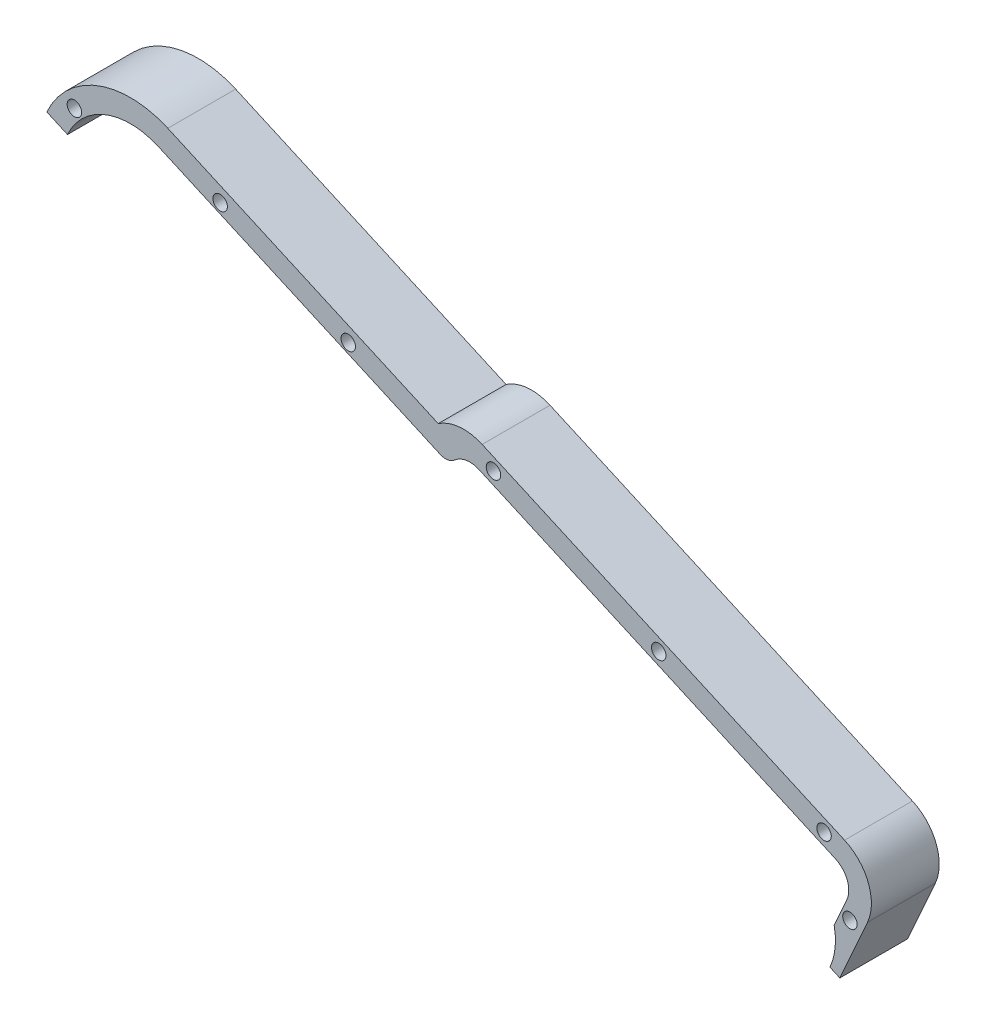
ISO-10303-21;
HEADER;
FILE_DESCRIPTION(('STEP AP214'),'2;1');
FILE_NAME('part.step','',(''),(''),'','','');
FILE_SCHEMA(('AUTOMOTIVE_DESIGN { 1 0 10303 214 1 1 1 1 }'));
ENDSEC;
DATA;
#1=APPLICATION_CONTEXT('core data for automotive mechanical design processes');
#2=APPLICATION_PROTOCOL_DEFINITION('international standard','automotive_design',2000,#1);
#3=PRODUCT_CONTEXT('',#1,'mechanical');
#4=PRODUCT('Part','Part','',(#3));
#5=PRODUCT_RELATED_PRODUCT_CATEGORY('part','',(#4));
#6=PRODUCT_DEFINITION_FORMATION('','',#4);
#7=PRODUCT_DEFINITION_CONTEXT('part definition',#1,'design');
#8=PRODUCT_DEFINITION('design','',#6,#7);
#9=PRODUCT_DEFINITION_SHAPE('','',#8);
#10=(LENGTH_UNIT() NAMED_UNIT(*) SI_UNIT(.MILLI.,.METRE.));
#11=(NAMED_UNIT(*) PLANE_ANGLE_UNIT() SI_UNIT($,.RADIAN.));
#12=(NAMED_UNIT(*) SI_UNIT($,.STERADIAN.) SOLID_ANGLE_UNIT());
#13=UNCERTAINTY_MEASURE_WITH_UNIT(LENGTH_MEASURE(1.E-05),#10,'distance_accuracy_value','');
#14=(GEOMETRIC_REPRESENTATION_CONTEXT(3) GLOBAL_UNCERTAINTY_ASSIGNED_CONTEXT((#13)) GLOBAL_UNIT_ASSIGNED_CONTEXT((#10,
#11,#12)) REPRESENTATION_CONTEXT('',''));
#15=CARTESIAN_POINT('',(0.,0.,0.));
#16=DIRECTION('',(0.,0.,1.));
#17=DIRECTION('',(1.,0.,0.));
#18=AXIS2_PLACEMENT_3D('',#15,#16,#17);
#19=CARTESIAN_POINT('',(-76.7868238041878,81.7037234737728,15.));
#20=DIRECTION('',(0.,0.,1.));
#21=DIRECTION('',(1.,0.,0.));
#22=AXIS2_PLACEMENT_3D('',#19,#20,#21);
#23=PLANE('',#22);
#24=CARTESIAN_POINT('',(-88.7287511209119,70.6042507911827,15.));
#25=DIRECTION('',(0.,0.,1.));
#26=DIRECTION('',(1.,0.,0.));
#27=AXIS2_PLACEMENT_3D('',#24,#25,#26);
#28=CIRCLE('',#27,14.);
#29=CARTESIAN_POINT('',(-75.941706574224,64.904119936455,15.));
#30=VERTEX_POINT('',#29);
#31=CARTESIAN_POINT('',(-75.0118010764204,73.4051937532801,15.));
#32=VERTEX_POINT('',#31);
#33=EDGE_CURVE('E146',#30,#32,#28,.T.);
#34=ORIENTED_EDGE('',*,*,#33,.F.);
#35=DIRECTION('',(-0.913360324763423,0.40715220390912,0.));
#36=VECTOR('',#35,1.);
#37=CARTESIAN_POINT('',(-249.039738927612,142.066706764681,15.));
#38=LINE('',#37,#36);
#39=CARTESIAN_POINT('',(-73.7605036151903,63.9317965632302,15.));
#40=VERTEX_POINT('',#39);
#41=EDGE_CURVE('E321',#40,#30,#38,.T.);
#42=ORIENTED_EDGE('',*,*,#41,.F.);
#43=DIRECTION('',(0.40715220390912,0.913360324763424,0.));
#44=VECTOR('',#43,1.);
#45=CARTESIAN_POINT('',(-79.8677866738272,50.2313916917789,15.));
#46=LINE('',#45,#44);
#47=CARTESIAN_POINT('',(-67.6532205565535,77.6322014346816,15.));
#48=VERTEX_POINT('',#47);
#49=EDGE_CURVE('E236',#40,#48,#46,.T.);
#50=ORIENTED_EDGE('',*,*,#49,.T.);
#51=CARTESIAN_POINT('',(-76.7868238041878,81.7037234737728,15.));
#52=DIRECTION('',(0.,0.,1.));
#53=DIRECTION('',(1.,0.,0.));
#54=AXIS2_PLACEMENT_3D('',#51,#52,#53);
#55=CIRCLE('',#54,9.99999999999999);
#56=CARTESIAN_POINT('',(-72.7153017650966,90.837326721407,15.));
#57=VERTEX_POINT('',#56);
#58=EDGE_CURVE('E223',#48,#57,#55,.T.);
#59=ORIENTED_EDGE('',*,*,#58,.T.);
#60=DIRECTION('',(-0.913360324763423,0.40715220390912,0.));
#61=VECTOR('',#60,1.);
#62=CARTESIAN_POINT('',(-72.7153017650966,90.837326721407,15.));
#63=LINE('',#62,#61);
#64=CARTESIAN_POINT('',(-152.817002246849,126.544575004237,15.));
#65=VERTEX_POINT('',#64);
#66=EDGE_CURVE('E226',#57,#65,#63,.T.);
#67=ORIENTED_EDGE('',*,*,#66,.T.);
#68=CARTESIAN_POINT('',(-156.88852428594,117.410971756603,15.));
#69=DIRECTION('',(0.,0.,1.));
#70=DIRECTION('',(1.,0.,0.));
#71=AXIS2_PLACEMENT_3D('',#68,#69,#70);
#72=CIRCLE('',#71,9.99999999999999);
#73=CARTESIAN_POINT('',(-162.524605275697,125.671394934437,15.));
#74=VERTEX_POINT('',#73);
#75=EDGE_CURVE('E229',#65,#74,#72,.T.);
#76=ORIENTED_EDGE('',*,*,#75,.T.);
#77=DIRECTION('',(-0.913360324763423,0.40715220390912,0.));
#78=VECTOR('',#77,1.);
#79=CARTESIAN_POINT('',(-162.524605275697,125.671394934437,15.));
#80=LINE('',#79,#78);
#81=CARTESIAN_POINT('',(-222.299360221993,152.317421211981,15.));
#82=VERTEX_POINT('',#81);
#83=EDGE_CURVE('E231',#74,#82,#80,.T.);
#84=ORIENTED_EDGE('',*,*,#83,.T.);
#85=CARTESIAN_POINT('',(-230.544192351153,133.821874635521,15.));
#86=DIRECTION('',(0.,0.,1.));
#87=DIRECTION('',(1.,0.,0.));
#88=AXIS2_PLACEMENT_3D('',#85,#86,#87);
#89=CIRCLE('',#88,20.25);
#90=CARTESIAN_POINT('',(-249.039738927612,142.066706764681,15.));
#91=VERTEX_POINT('',#90);
#92=EDGE_CURVE('E233',#82,#91,#89,.T.);
#93=ORIENTED_EDGE('',*,*,#92,.T.);
#94=CARTESIAN_POINT('',(-244.472937303795,140.030945745135,15.));
#95=VERTEX_POINT('',#94);
#96=EDGE_CURVE('E317',#95,#91,#38,.T.);
#97=ORIENTED_EDGE('',*,*,#96,.F.);
#98=CARTESIAN_POINT('',(-230.544192351153,133.821874635521,15.));
#99=DIRECTION('',(0.,0.,1.));
#100=DIRECTION('',(1.,0.,0.));
#101=AXIS2_PLACEMENT_3D('',#98,#99,#100);
#102=CIRCLE('',#101,15.25);
#103=CARTESIAN_POINT('',(-224.335121241539,147.750619588163,15.));
#104=VERTEX_POINT('',#103);
#105=EDGE_CURVE('E310',#104,#95,#102,.T.);
#106=ORIENTED_EDGE('',*,*,#105,.F.);
#107=DIRECTION('',(-0.913360324763423,0.40715220390912,0.));
#108=VECTOR('',#107,1.);
#109=CARTESIAN_POINT('',(-147.743052941724,113.607873768429,15.));
#110=LINE('',#109,#108);
#111=CARTESIAN_POINT('',(-162.103514483741,120.009392870432,15.));
#112=VERTEX_POINT('',#111);
#113=EDGE_CURVE('E162',#112,#104,#110,.T.);
#114=ORIENTED_EDGE('',*,*,#113,.F.);
#115=CARTESIAN_POINT('',(-160.882057872014,122.749473844722,15.));
#116=DIRECTION('',(0.,0.,1.));
#117=DIRECTION('',(1.,0.,0.));
#118=AXIS2_PLACEMENT_3D('',#115,#116,#117);
#119=CIRCLE('',#118,3.);
#120=CARTESIAN_POINT('',(-158.874492831978,120.520195349328,15.));
#121=VERTEX_POINT('',#120);
#122=EDGE_CURVE('E43',#112,#121,#119,.T.);
#123=ORIENTED_EDGE('',*,*,#122,.T.);
#124=CARTESIAN_POINT('',(-155.528551098586,116.804731190338,15.));
#125=DIRECTION('',(0.,0.,1.));
#126=DIRECTION('',(1.,0.,0.));
#127=AXIS2_PLACEMENT_3D('',#124,#125,#126);
#128=CIRCLE('',#127,5.);
#129=CARTESIAN_POINT('',(-153.49279007904,121.371532814155,15.));
#130=VERTEX_POINT('',#129);
#131=EDGE_CURVE('E268',#121,#130,#128,.F.);
#132=ORIENTED_EDGE('',*,*,#131,.T.);
#133=DIRECTION('',(-0.913360324763423,0.40715220390912,0.));
#134=VECTOR('',#133,1.);
#135=CARTESIAN_POINT('',(-158.059591702857,123.4072938337,15.));
#136=LINE('',#135,#134);
#137=CARTESIAN_POINT('',(-74.7510627846422,86.27052509759,15.));
#138=VERTEX_POINT('',#137);
#139=EDGE_CURVE('E168',#138,#130,#136,.T.);
#140=ORIENTED_EDGE('',*,*,#139,.F.);
#141=CARTESIAN_POINT('',(-76.7868238041878,81.7037234737728,15.));
#142=DIRECTION('',(0.,0.,1.));
#143=DIRECTION('',(1.,0.,0.));
#144=AXIS2_PLACEMENT_3D('',#141,#142,#143);
#145=CIRCLE('',#144,5.);
#146=CARTESIAN_POINT('',(-72.2200221803707,79.6679624542272,15.));
#147=VERTEX_POINT('',#146);
#148=EDGE_CURVE('E166',#138,#147,#145,.F.);
#149=ORIENTED_EDGE('',*,*,#148,.T.);
#150=DIRECTION('',(0.40715220390912,0.913360324763423,0.));
#151=VECTOR('',#150,1.);
#152=CARTESIAN_POINT('',(-70.1842611608251,84.2347640780443,15.));
#153=LINE('',#152,#151);
#154=EDGE_CURVE('E159',#32,#147,#153,.T.);
#155=ORIENTED_EDGE('',*,*,#154,.F.);
#156=EDGE_LOOP('',(#34,#42,#50,#59,#67,#76,#84,#93,#97,#106,#114,#123,#132,#140,#149,#155));
#157=FACE_BOUND('',#156,.T.);
#158=CARTESIAN_POINT('',(-242.947351213455,145.810375385677,15.));
#159=DIRECTION('',(0.,0.,1.));
#160=DIRECTION('',(1.,0.,0.));
#161=AXIS2_PLACEMENT_3D('',#158,#159,#160);
#162=CIRCLE('',#161,1.59999999999999);
#163=CARTESIAN_POINT('',(-241.347351213455,145.810375385677,15.));
#164=VERTEX_POINT('',#163);
#165=EDGE_CURVE('E184',#164,#164,#162,.T.);
#166=ORIENTED_EDGE('',*,*,#165,.F.);
#167=EDGE_LOOP('',(#166));
#168=FACE_BOUND('',#167,.T.);
#169=CARTESIAN_POINT('',(-182.419602219367,131.25549106178,15.));
#170=DIRECTION('',(0.,0.,1.));
#171=DIRECTION('',(1.,0.,0.));
#172=AXIS2_PLACEMENT_3D('',#169,#170,#171);
#173=CIRCLE('',#172,1.59999999999999);
#174=CARTESIAN_POINT('',(-180.819602219367,131.25549106178,15.));
#175=VERTEX_POINT('',#174);
#176=EDGE_CURVE('E183',#175,#175,#173,.T.);
#177=ORIENTED_EDGE('',*,*,#176,.F.);
#178=EDGE_LOOP('',(#177));
#179=FACE_BOUND('',#178,.T.);
#180=CARTESIAN_POINT('',(-210.733772287033,143.877209382963,15.));
#181=DIRECTION('',(0.,0.,1.));
#182=DIRECTION('',(1.,0.,0.));
#183=AXIS2_PLACEMENT_3D('',#180,#181,#182);
#184=CIRCLE('',#183,1.59999999999999);
#185=CARTESIAN_POINT('',(-209.133772287033,143.877209382963,15.));
#186=VERTEX_POINT('',#185);
#187=EDGE_CURVE('E190',#186,#186,#184,.T.);
#188=ORIENTED_EDGE('',*,*,#187,.F.);
#189=EDGE_LOOP('',(#188));
#190=FACE_BOUND('',#189,.T.);
#191=CARTESIAN_POINT('',(-71.5234221100948,76.0728618517278,15.));
#192=DIRECTION('',(0.,0.,1.));
#193=DIRECTION('',(1.,0.,0.));
#194=AXIS2_PLACEMENT_3D('',#191,#192,#193);
#195=CIRCLE('',#194,1.60000000000001);
#196=CARTESIAN_POINT('',(-69.9234221100948,76.0728618517278,15.));
#197=VERTEX_POINT('',#196);
#198=EDGE_CURVE('E199',#197,#197,#195,.T.);
#199=ORIENTED_EDGE('',*,*,#198,.F.);
#200=EDGE_LOOP('',(#199));
#201=FACE_BOUND('',#200,.T.);
#202=CARTESIAN_POINT('',(-77.2496195252085,90.1214618945486,15.));
#203=DIRECTION('',(0.,0.,1.));
#204=DIRECTION('',(1.,0.,0.));
#205=AXIS2_PLACEMENT_3D('',#202,#203,#204);
#206=CIRCLE('',#205,1.60000000000001);
#207=CARTESIAN_POINT('',(-75.6496195252085,90.1214618945486,15.));
#208=VERTEX_POINT('',#207);
#209=EDGE_CURVE('E205',#208,#208,#206,.T.);
#210=ORIENTED_EDGE('',*,*,#209,.F.);
#211=EDGE_LOOP('',(#210));
#212=FACE_BOUND('',#211,.T.);
#213=CARTESIAN_POINT('',(-150.318445506282,122.693638207278,15.));
#214=DIRECTION('',(0.,0.,1.));
#215=DIRECTION('',(1.,0.,0.));
#216=AXIS2_PLACEMENT_3D('',#213,#214,#215);
#217=CIRCLE('',#216,1.59999999999999);
#218=CARTESIAN_POINT('',(-148.718445506282,122.693638207278,15.));
#219=VERTEX_POINT('',#218);
#220=EDGE_CURVE('E217',#219,#219,#217,.T.);
#221=ORIENTED_EDGE('',*,*,#220,.F.);
#222=EDGE_LOOP('',(#221));
#223=FACE_BOUND('',#222,.T.);
#224=CARTESIAN_POINT('',(-113.784032515745,106.407550050913,15.));
#225=DIRECTION('',(0.,0.,1.));
#226=DIRECTION('',(1.,0.,0.));
#227=AXIS2_PLACEMENT_3D('',#224,#225,#226);
#228=CIRCLE('',#227,1.60000000000001);
#229=CARTESIAN_POINT('',(-112.184032515745,106.407550050913,15.));
#230=VERTEX_POINT('',#229);
#231=EDGE_CURVE('E211',#230,#230,#228,.T.);
#232=ORIENTED_EDGE('',*,*,#231,.F.);
#233=EDGE_LOOP('',(#232));
#234=FACE_BOUND('',#233,.T.);
#235=ADVANCED_FACE('F35',(#157,#168,#179,#190,#201,#212,#223,#234),#23,.T.);
#236=CARTESIAN_POINT('',(-76.7868238041878,81.7037234737728,0.));
#237=DIRECTION('',(0.,0.,1.));
#238=DIRECTION('',(1.,0.,0.));
#239=AXIS2_PLACEMENT_3D('',#236,#237,#238);
#240=PLANE('',#239);
#241=DIRECTION('',(-0.913360324763423,0.40715220390912,0.));
#242=VECTOR('',#241,1.);
#243=CARTESIAN_POINT('',(-249.039738927612,142.066706764681,0.));
#244=LINE('',#243,#242);
#245=CARTESIAN_POINT('',(-73.7605036151903,63.9317965632302,0.));
#246=VERTEX_POINT('',#245);
#247=CARTESIAN_POINT('',(-75.941706574224,64.904119936455,0.));
#248=VERTEX_POINT('',#247);
#249=EDGE_CURVE('E318',#246,#248,#244,.T.);
#250=ORIENTED_EDGE('',*,*,#249,.T.);
#251=CARTESIAN_POINT('',(-88.7287511209119,70.6042507911827,0.));
#252=DIRECTION('',(0.,0.,1.));
#253=DIRECTION('',(1.,0.,0.));
#254=AXIS2_PLACEMENT_3D('',#251,#252,#253);
#255=CIRCLE('',#254,14.);
#256=CARTESIAN_POINT('',(-75.0118010764204,73.4051937532801,0.));
#257=VERTEX_POINT('',#256);
#258=EDGE_CURVE('E50',#248,#257,#255,.T.);
#259=ORIENTED_EDGE('',*,*,#258,.T.);
#260=DIRECTION('',(0.40715220390912,0.913360324763423,0.));
#261=VECTOR('',#260,1.);
#262=CARTESIAN_POINT('',(-70.1842611608251,84.2347640780443,0.));
#263=LINE('',#262,#261);
#264=CARTESIAN_POINT('',(-72.2200221803707,79.6679624542272,0.));
#265=VERTEX_POINT('',#264);
#266=EDGE_CURVE('E161',#257,#265,#263,.T.);
#267=ORIENTED_EDGE('',*,*,#266,.T.);
#268=CARTESIAN_POINT('',(-76.7868238041878,81.7037234737728,0.));
#269=DIRECTION('',(0.,0.,1.));
#270=DIRECTION('',(1.,0.,0.));
#271=AXIS2_PLACEMENT_3D('',#268,#269,#270);
#272=CIRCLE('',#271,5.);
#273=CARTESIAN_POINT('',(-74.7510627846422,86.27052509759,0.));
#274=VERTEX_POINT('',#273);
#275=EDGE_CURVE('E279',#265,#274,#272,.T.);
#276=ORIENTED_EDGE('',*,*,#275,.T.);
#277=DIRECTION('',(-0.913360324763423,0.40715220390912,0.));
#278=VECTOR('',#277,1.);
#279=CARTESIAN_POINT('',(-158.059591702857,123.4072938337,0.));
#280=LINE('',#279,#278);
#281=CARTESIAN_POINT('',(-153.49279007904,121.371532814155,0.));
#282=VERTEX_POINT('',#281);
#283=EDGE_CURVE('E177',#274,#282,#280,.T.);
#284=ORIENTED_EDGE('',*,*,#283,.T.);
#285=CARTESIAN_POINT('',(-155.528551098586,116.804731190338,0.));
#286=DIRECTION('',(0.,0.,1.));
#287=DIRECTION('',(1.,0.,0.));
#288=AXIS2_PLACEMENT_3D('',#285,#286,#287);
#289=CIRCLE('',#288,5.);
#290=CARTESIAN_POINT('',(-158.874492831978,120.520195349328,0.));
#291=VERTEX_POINT('',#290);
#292=EDGE_CURVE('E270',#282,#291,#289,.T.);
#293=ORIENTED_EDGE('',*,*,#292,.T.);
#294=CARTESIAN_POINT('',(-160.882057872014,122.749473844722,0.));
#295=DIRECTION('',(0.,0.,1.));
#296=DIRECTION('',(1.,0.,0.));
#297=AXIS2_PLACEMENT_3D('',#294,#295,#296);
#298=CIRCLE('',#297,3.);
#299=CARTESIAN_POINT('',(-162.103514483741,120.009392870432,0.));
#300=VERTEX_POINT('',#299);
#301=EDGE_CURVE('E287',#291,#300,#298,.F.);
#302=ORIENTED_EDGE('',*,*,#301,.T.);
#303=DIRECTION('',(-0.913360324763423,0.40715220390912,0.));
#304=VECTOR('',#303,1.);
#305=CARTESIAN_POINT('',(-147.743052941724,113.607873768429,0.));
#306=LINE('',#305,#304);
#307=CARTESIAN_POINT('',(-224.335121241539,147.750619588163,0.));
#308=VERTEX_POINT('',#307);
#309=EDGE_CURVE('E303',#300,#308,#306,.T.);
#310=ORIENTED_EDGE('',*,*,#309,.T.);
#311=CARTESIAN_POINT('',(-230.544192351153,133.821874635521,0.));
#312=DIRECTION('',(0.,0.,1.));
#313=DIRECTION('',(1.,0.,0.));
#314=AXIS2_PLACEMENT_3D('',#311,#312,#313);
#315=CIRCLE('',#314,15.25);
#316=CARTESIAN_POINT('',(-244.472937303795,140.030945745135,0.));
#317=VERTEX_POINT('',#316);
#318=EDGE_CURVE('E309',#308,#317,#315,.T.);
#319=ORIENTED_EDGE('',*,*,#318,.T.);
#320=CARTESIAN_POINT('',(-249.039738927612,142.066706764681,0.));
#321=VERTEX_POINT('',#320);
#322=EDGE_CURVE('E320',#317,#321,#244,.T.);
#323=ORIENTED_EDGE('',*,*,#322,.T.);
#324=CARTESIAN_POINT('',(-230.544192351153,133.821874635521,0.));
#325=DIRECTION('',(0.,0.,1.));
#326=DIRECTION('',(1.,0.,0.));
#327=AXIS2_PLACEMENT_3D('',#324,#325,#326);
#328=CIRCLE('',#327,20.25);
#329=CARTESIAN_POINT('',(-222.299360221993,152.317421211981,0.));
#330=VERTEX_POINT('',#329);
#331=EDGE_CURVE('E247',#330,#321,#328,.T.);
#332=ORIENTED_EDGE('',*,*,#331,.F.);
#333=DIRECTION('',(-0.913360324763423,0.40715220390912,0.));
#334=VECTOR('',#333,1.);
#335=CARTESIAN_POINT('',(-162.524605275697,125.671394934437,0.));
#336=LINE('',#335,#334);
#337=CARTESIAN_POINT('',(-162.524605275697,125.671394934437,0.));
#338=VERTEX_POINT('',#337);
#339=EDGE_CURVE('E245',#338,#330,#336,.T.);
#340=ORIENTED_EDGE('',*,*,#339,.F.);
#341=CARTESIAN_POINT('',(-156.88852428594,117.410971756603,0.));
#342=DIRECTION('',(0.,0.,1.));
#343=DIRECTION('',(1.,0.,0.));
#344=AXIS2_PLACEMENT_3D('',#341,#342,#343);
#345=CIRCLE('',#344,9.99999999999999);
#346=CARTESIAN_POINT('',(-152.817002246849,126.544575004237,0.));
#347=VERTEX_POINT('',#346);
#348=EDGE_CURVE('E243',#347,#338,#345,.T.);
#349=ORIENTED_EDGE('',*,*,#348,.F.);
#350=DIRECTION('',(-0.913360324763423,0.40715220390912,0.));
#351=VECTOR('',#350,1.);
#352=CARTESIAN_POINT('',(-72.7153017650966,90.837326721407,0.));
#353=LINE('',#352,#351);
#354=CARTESIAN_POINT('',(-72.7153017650966,90.837326721407,0.));
#355=VERTEX_POINT('',#354);
#356=EDGE_CURVE('E241',#355,#347,#353,.T.);
#357=ORIENTED_EDGE('',*,*,#356,.F.);
#358=CARTESIAN_POINT('',(-76.7868238041878,81.7037234737728,0.));
#359=DIRECTION('',(0.,0.,1.));
#360=DIRECTION('',(1.,0.,0.));
#361=AXIS2_PLACEMENT_3D('',#358,#359,#360);
#362=CIRCLE('',#361,9.99999999999999);
#363=CARTESIAN_POINT('',(-67.6532205565535,77.6322014346816,0.));
#364=VERTEX_POINT('',#363);
#365=EDGE_CURVE('E220',#364,#355,#362,.T.);
#366=ORIENTED_EDGE('',*,*,#365,.F.);
#367=DIRECTION('',(0.40715220390912,0.913360324763424,0.));
#368=VECTOR('',#367,1.);
#369=CARTESIAN_POINT('',(-79.8677866738272,50.2313916917789,0.));
#370=LINE('',#369,#368);
#371=EDGE_CURVE('E227',#246,#364,#370,.T.);
#372=ORIENTED_EDGE('',*,*,#371,.F.);
#373=EDGE_LOOP('',(#250,#259,#267,#276,#284,#293,#302,#310,#319,#323,#332,#340,#349,#357,#366,#372));
#374=FACE_BOUND('',#373,.T.);
#375=CARTESIAN_POINT('',(-242.947351213455,145.810375385677,0.));
#376=DIRECTION('',(0.,0.,1.));
#377=DIRECTION('',(1.,0.,0.));
#378=AXIS2_PLACEMENT_3D('',#375,#376,#377);
#379=CIRCLE('',#378,1.59999999999999);
#380=CARTESIAN_POINT('',(-241.347351213455,145.810375385677,0.));
#381=VERTEX_POINT('',#380);
#382=EDGE_CURVE('E180',#381,#381,#379,.T.);
#383=ORIENTED_EDGE('',*,*,#382,.T.);
#384=EDGE_LOOP('',(#383));
#385=FACE_BOUND('',#384,.T.);
#386=CARTESIAN_POINT('',(-182.419602219367,131.25549106178,0.));
#387=DIRECTION('',(0.,0.,1.));
#388=DIRECTION('',(1.,0.,0.));
#389=AXIS2_PLACEMENT_3D('',#386,#387,#388);
#390=CIRCLE('',#389,1.59999999999999);
#391=CARTESIAN_POINT('',(-180.819602219367,131.25549106178,0.));
#392=VERTEX_POINT('',#391);
#393=EDGE_CURVE('E187',#392,#392,#390,.T.);
#394=ORIENTED_EDGE('',*,*,#393,.T.);
#395=EDGE_LOOP('',(#394));
#396=FACE_BOUND('',#395,.T.);
#397=CARTESIAN_POINT('',(-210.733772287033,143.877209382963,0.));
#398=DIRECTION('',(0.,0.,1.));
#399=DIRECTION('',(1.,0.,0.));
#400=AXIS2_PLACEMENT_3D('',#397,#398,#399);
#401=CIRCLE('',#400,1.59999999999999);
#402=CARTESIAN_POINT('',(-209.133772287033,143.877209382963,0.));
#403=VERTEX_POINT('',#402);
#404=EDGE_CURVE('E193',#403,#403,#401,.T.);
#405=ORIENTED_EDGE('',*,*,#404,.T.);
#406=EDGE_LOOP('',(#405));
#407=FACE_BOUND('',#406,.T.);
#408=CARTESIAN_POINT('',(-150.318445506282,122.693638207278,0.));
#409=DIRECTION('',(0.,0.,1.));
#410=DIRECTION('',(1.,0.,0.));
#411=AXIS2_PLACEMENT_3D('',#408,#409,#410);
#412=CIRCLE('',#411,1.59999999999999);
#413=CARTESIAN_POINT('',(-148.718445506282,122.693638207278,0.));
#414=VERTEX_POINT('',#413);
#415=EDGE_CURVE('E214',#414,#414,#412,.T.);
#416=ORIENTED_EDGE('',*,*,#415,.T.);
#417=EDGE_LOOP('',(#416));
#418=FACE_BOUND('',#417,.T.);
#419=CARTESIAN_POINT('',(-113.784032515745,106.407550050913,0.));
#420=DIRECTION('',(0.,0.,1.));
#421=DIRECTION('',(1.,0.,0.));
#422=AXIS2_PLACEMENT_3D('',#419,#420,#421);
#423=CIRCLE('',#422,1.60000000000001);
#424=CARTESIAN_POINT('',(-112.184032515745,106.407550050913,0.));
#425=VERTEX_POINT('',#424);
#426=EDGE_CURVE('E208',#425,#425,#423,.T.);
#427=ORIENTED_EDGE('',*,*,#426,.T.);
#428=EDGE_LOOP('',(#427));
#429=FACE_BOUND('',#428,.T.);
#430=CARTESIAN_POINT('',(-77.2496195252085,90.1214618945486,0.));
#431=DIRECTION('',(0.,0.,1.));
#432=DIRECTION('',(1.,0.,0.));
#433=AXIS2_PLACEMENT_3D('',#430,#431,#432);
#434=CIRCLE('',#433,1.60000000000001);
#435=CARTESIAN_POINT('',(-75.6496195252085,90.1214618945486,0.));
#436=VERTEX_POINT('',#435);
#437=EDGE_CURVE('E202',#436,#436,#434,.T.);
#438=ORIENTED_EDGE('',*,*,#437,.T.);
#439=EDGE_LOOP('',(#438));
#440=FACE_BOUND('',#439,.T.);
#441=CARTESIAN_POINT('',(-71.5234221100948,76.0728618517278,0.));
#442=DIRECTION('',(0.,0.,1.));
#443=DIRECTION('',(1.,0.,0.));
#444=AXIS2_PLACEMENT_3D('',#441,#442,#443);
#445=CIRCLE('',#444,1.60000000000001);
#446=CARTESIAN_POINT('',(-69.9234221100948,76.0728618517278,0.));
#447=VERTEX_POINT('',#446);
#448=EDGE_CURVE('E196',#447,#447,#445,.T.);
#449=ORIENTED_EDGE('',*,*,#448,.T.);
#450=EDGE_LOOP('',(#449));
#451=FACE_BOUND('',#450,.T.);
#452=ADVANCED_FACE('F300',(#374,#385,#396,#407,#418,#429,#440,#451),#240,.F.);
#453=CARTESIAN_POINT('',(-76.7868238041878,81.7037234737728,15.));
#454=DIRECTION('',(0.,0.,-1.));
#455=DIRECTION('',(-1.,0.,0.));
#456=AXIS2_PLACEMENT_3D('',#453,#454,#455);
#457=CYLINDRICAL_SURFACE('',#456,9.99999999999999);
#458=ORIENTED_EDGE('',*,*,#365,.T.);
#459=DIRECTION('',(0.,0.,-1.));
#460=VECTOR('',#459,1.);
#461=CARTESIAN_POINT('',(-72.7153017650966,90.837326721407,15.));
#462=LINE('',#461,#460);
#463=EDGE_CURVE('E262',#57,#355,#462,.T.);
#464=ORIENTED_EDGE('',*,*,#463,.F.);
#465=ORIENTED_EDGE('',*,*,#58,.F.);
#466=DIRECTION('',(0.,0.,-1.));
#467=VECTOR('',#466,1.);
#468=CARTESIAN_POINT('',(-67.6532205565535,77.6322014346816,15.));
#469=LINE('',#468,#467);
#470=EDGE_CURVE('E238',#48,#364,#469,.T.);
#471=ORIENTED_EDGE('',*,*,#470,.T.);
#472=EDGE_LOOP('',(#458,#464,#465,#471));
#473=FACE_BOUND('',#472,.T.);
#474=ADVANCED_FACE('F345',(#473),#457,.T.);
#475=CARTESIAN_POINT('',(-72.7153017650966,90.837326721407,15.));
#476=DIRECTION('',(-0.40715220390912,-0.913360324763423,0.));
#477=DIRECTION('',(0.913360324763424,-0.40715220390912,0.));
#478=AXIS2_PLACEMENT_3D('',#475,#476,#477);
#479=PLANE('',#478);
#480=ORIENTED_EDGE('',*,*,#356,.T.);
#481=DIRECTION('',(0.,0.,-1.));
#482=VECTOR('',#481,1.);
#483=CARTESIAN_POINT('',(-152.817002246849,126.544575004237,15.));
#484=LINE('',#483,#482);
#485=EDGE_CURVE('E259',#65,#347,#484,.T.);
#486=ORIENTED_EDGE('',*,*,#485,.F.);
#487=ORIENTED_EDGE('',*,*,#66,.F.);
#488=ORIENTED_EDGE('',*,*,#463,.T.);
#489=EDGE_LOOP('',(#480,#486,#487,#488));
#490=FACE_BOUND('',#489,.T.);
#491=ADVANCED_FACE('F366',(#490),#479,.F.);
#492=CARTESIAN_POINT('',(-156.88852428594,117.410971756603,15.));
#493=DIRECTION('',(0.,0.,-1.));
#494=DIRECTION('',(-1.,0.,0.));
#495=AXIS2_PLACEMENT_3D('',#492,#493,#494);
#496=CYLINDRICAL_SURFACE('',#495,9.99999999999999);
#497=ORIENTED_EDGE('',*,*,#348,.T.);
#498=DIRECTION('',(0.,0.,-1.));
#499=VECTOR('',#498,1.);
#500=CARTESIAN_POINT('',(-162.524605275697,125.671394934437,15.));
#501=LINE('',#500,#499);
#502=EDGE_CURVE('E256',#74,#338,#501,.T.);
#503=ORIENTED_EDGE('',*,*,#502,.F.);
#504=ORIENTED_EDGE('',*,*,#75,.F.);
#505=ORIENTED_EDGE('',*,*,#485,.T.);
#506=EDGE_LOOP('',(#497,#503,#504,#505));
#507=FACE_BOUND('',#506,.T.);
#508=ADVANCED_FACE('F362',(#507),#496,.T.);
#509=CARTESIAN_POINT('',(-162.524605275697,125.671394934437,15.));
#510=DIRECTION('',(-0.40715220390912,-0.913360324763423,0.));
#511=DIRECTION('',(0.913360324763423,-0.40715220390912,0.));
#512=AXIS2_PLACEMENT_3D('',#509,#510,#511);
#513=PLANE('',#512);
#514=ORIENTED_EDGE('',*,*,#339,.T.);
#515=DIRECTION('',(0.,0.,-1.));
#516=VECTOR('',#515,1.);
#517=CARTESIAN_POINT('',(-222.299360221993,152.317421211981,15.));
#518=LINE('',#517,#516);
#519=EDGE_CURVE('E253',#82,#330,#518,.T.);
#520=ORIENTED_EDGE('',*,*,#519,.F.);
#521=ORIENTED_EDGE('',*,*,#83,.F.);
#522=ORIENTED_EDGE('',*,*,#502,.T.);
#523=EDGE_LOOP('',(#514,#520,#521,#522));
#524=FACE_BOUND('',#523,.T.);
#525=ADVANCED_FACE('F358',(#524),#513,.F.);
#526=CARTESIAN_POINT('',(-230.544192351153,133.821874635521,15.));
#527=DIRECTION('',(0.,0.,-1.));
#528=DIRECTION('',(-1.,0.,0.));
#529=AXIS2_PLACEMENT_3D('',#526,#527,#528);
#530=CYLINDRICAL_SURFACE('',#529,20.25);
#531=ORIENTED_EDGE('',*,*,#331,.T.);
#532=DIRECTION('',(0.,0.,1.));
#533=VECTOR('',#532,1.);
#534=CARTESIAN_POINT('',(-249.039738927612,142.066706764681,0.));
#535=LINE('',#534,#533);
#536=EDGE_CURVE('E169',#321,#91,#535,.T.);
#537=ORIENTED_EDGE('',*,*,#536,.T.);
#538=ORIENTED_EDGE('',*,*,#92,.F.);
#539=ORIENTED_EDGE('',*,*,#519,.T.);
#540=EDGE_LOOP('',(#531,#537,#538,#539));
#541=FACE_BOUND('',#540,.T.);
#542=ADVANCED_FACE('F354',(#541),#530,.T.);
#543=CARTESIAN_POINT('',(-79.8677866738272,50.2313916917789,15.));
#544=DIRECTION('',(-0.913360324763423,0.40715220390912,0.));
#545=DIRECTION('',(-0.40715220390912,-0.913360324763423,0.));
#546=AXIS2_PLACEMENT_3D('',#543,#544,#545);
#547=PLANE('',#546);
#548=ORIENTED_EDGE('',*,*,#49,.F.);
#549=DIRECTION('',(0.,0.,1.));
#550=VECTOR('',#549,1.);
#551=CARTESIAN_POINT('',(-73.7605036151903,63.9317965632302,0.));
#552=LINE('',#551,#550);
#553=EDGE_CURVE('E174',#246,#40,#552,.T.);
#554=ORIENTED_EDGE('',*,*,#553,.F.);
#555=ORIENTED_EDGE('',*,*,#371,.T.);
#556=ORIENTED_EDGE('',*,*,#470,.F.);
#557=EDGE_LOOP('',(#548,#554,#555,#556));
#558=FACE_BOUND('',#557,.T.);
#559=ADVANCED_FACE('F351',(#558),#547,.F.);
#560=CARTESIAN_POINT('',(-150.318445506282,122.693638207278,15.));
#561=DIRECTION('',(0.,0.,-1.));
#562=DIRECTION('',(-1.,0.,0.));
#563=AXIS2_PLACEMENT_3D('',#560,#561,#562);
#564=CYLINDRICAL_SURFACE('',#563,1.59999999999999);
#565=ORIENTED_EDGE('',*,*,#220,.T.);
#566=EDGE_LOOP('',(#565));
#567=FACE_BOUND('',#566,.T.);
#568=ORIENTED_EDGE('',*,*,#415,.F.);
#569=EDGE_LOOP('',(#568));
#570=FACE_BOUND('',#569,.T.);
#571=ADVANCED_FACE('F348',(#567,#570),#564,.F.);
#572=CARTESIAN_POINT('',(-113.784032515745,106.407550050913,15.));
#573=DIRECTION('',(0.,0.,-1.));
#574=DIRECTION('',(-1.,0.,0.));
#575=AXIS2_PLACEMENT_3D('',#572,#573,#574);
#576=CYLINDRICAL_SURFACE('',#575,1.60000000000001);
#577=ORIENTED_EDGE('',*,*,#231,.T.);
#578=EDGE_LOOP('',(#577));
#579=FACE_BOUND('',#578,.T.);
#580=ORIENTED_EDGE('',*,*,#426,.F.);
#581=EDGE_LOOP('',(#580));
#582=FACE_BOUND('',#581,.T.);
#583=ADVANCED_FACE('F430',(#579,#582),#576,.F.);
#584=CARTESIAN_POINT('',(-77.2496195252085,90.1214618945486,15.));
#585=DIRECTION('',(0.,0.,-1.));
#586=DIRECTION('',(-1.,0.,0.));
#587=AXIS2_PLACEMENT_3D('',#584,#585,#586);
#588=CYLINDRICAL_SURFACE('',#587,1.60000000000001);
#589=ORIENTED_EDGE('',*,*,#209,.T.);
#590=EDGE_LOOP('',(#589));
#591=FACE_BOUND('',#590,.T.);
#592=ORIENTED_EDGE('',*,*,#437,.F.);
#593=EDGE_LOOP('',(#592));
#594=FACE_BOUND('',#593,.T.);
#595=ADVANCED_FACE('F427',(#591,#594),#588,.F.);
#596=CARTESIAN_POINT('',(-71.5234221100948,76.0728618517278,15.));
#597=DIRECTION('',(0.,0.,-1.));
#598=DIRECTION('',(-1.,0.,0.));
#599=AXIS2_PLACEMENT_3D('',#596,#597,#598);
#600=CYLINDRICAL_SURFACE('',#599,1.60000000000001);
#601=ORIENTED_EDGE('',*,*,#198,.T.);
#602=EDGE_LOOP('',(#601));
#603=FACE_BOUND('',#602,.T.);
#604=ORIENTED_EDGE('',*,*,#448,.F.);
#605=EDGE_LOOP('',(#604));
#606=FACE_BOUND('',#605,.T.);
#607=ADVANCED_FACE('F423',(#603,#606),#600,.F.);
#608=CARTESIAN_POINT('',(-210.733772287033,143.877209382963,0.));
#609=DIRECTION('',(0.,0.,1.));
#610=DIRECTION('',(1.,0.,0.));
#611=AXIS2_PLACEMENT_3D('',#608,#609,#610);
#612=CYLINDRICAL_SURFACE('',#611,1.59999999999999);
#613=ORIENTED_EDGE('',*,*,#404,.F.);
#614=EDGE_LOOP('',(#613));
#615=FACE_BOUND('',#614,.T.);
#616=ORIENTED_EDGE('',*,*,#187,.T.);
#617=EDGE_LOOP('',(#616));
#618=FACE_BOUND('',#617,.T.);
#619=ADVANCED_FACE('F419',(#615,#618),#612,.F.);
#620=CARTESIAN_POINT('',(-182.419602219367,131.25549106178,0.));
#621=DIRECTION('',(0.,0.,1.));
#622=DIRECTION('',(1.,0.,0.));
#623=AXIS2_PLACEMENT_3D('',#620,#621,#622);
#624=CYLINDRICAL_SURFACE('',#623,1.59999999999999);
#625=ORIENTED_EDGE('',*,*,#393,.F.);
#626=EDGE_LOOP('',(#625));
#627=FACE_BOUND('',#626,.T.);
#628=ORIENTED_EDGE('',*,*,#176,.T.);
#629=EDGE_LOOP('',(#628));
#630=FACE_BOUND('',#629,.T.);
#631=ADVANCED_FACE('F415',(#627,#630),#624,.F.);
#632=CARTESIAN_POINT('',(-242.947351213455,145.810375385677,0.));
#633=DIRECTION('',(0.,0.,1.));
#634=DIRECTION('',(1.,0.,0.));
#635=AXIS2_PLACEMENT_3D('',#632,#633,#634);
#636=CYLINDRICAL_SURFACE('',#635,1.59999999999999);
#637=ORIENTED_EDGE('',*,*,#382,.F.);
#638=EDGE_LOOP('',(#637));
#639=FACE_BOUND('',#638,.T.);
#640=ORIENTED_EDGE('',*,*,#165,.T.);
#641=EDGE_LOOP('',(#640));
#642=FACE_BOUND('',#641,.T.);
#643=ADVANCED_FACE('F410',(#639,#642),#636,.F.);
#644=CARTESIAN_POINT('',(-158.059591702857,123.4072938337,0.));
#645=DIRECTION('',(0.40715220390912,0.913360324763424,0.));
#646=DIRECTION('',(-0.913360324763424,0.40715220390912,0.));
#647=AXIS2_PLACEMENT_3D('',#644,#645,#646);
#648=PLANE('',#647);
#649=ORIENTED_EDGE('',*,*,#283,.F.);
#650=DIRECTION('',(0.,0.,1.));
#651=VECTOR('',#650,1.);
#652=CARTESIAN_POINT('',(-74.7510627846422,86.2705250975899,15.));
#653=LINE('',#652,#651);
#654=EDGE_CURVE('E275',#274,#138,#653,.T.);
#655=ORIENTED_EDGE('',*,*,#654,.T.);
#656=ORIENTED_EDGE('',*,*,#139,.T.);
#657=DIRECTION('',(0.,0.,1.));
#658=VECTOR('',#657,1.);
#659=CARTESIAN_POINT('',(-153.49279007904,121.371532814155,0.));
#660=LINE('',#659,#658);
#661=EDGE_CURVE('E265',#130,#282,#660,.F.);
#662=ORIENTED_EDGE('',*,*,#661,.T.);
#663=EDGE_LOOP('',(#649,#655,#656,#662));
#664=FACE_BOUND('',#663,.T.);
#665=ADVANCED_FACE('F327',(#664),#648,.F.);
#666=CARTESIAN_POINT('',(-70.1842611608251,84.2347640780443,0.));
#667=DIRECTION('',(0.913360324763424,-0.40715220390912,0.));
#668=DIRECTION('',(0.40715220390912,0.913360324763424,0.));
#669=AXIS2_PLACEMENT_3D('',#666,#667,#668);
#670=PLANE('',#669);
#671=ORIENTED_EDGE('',*,*,#266,.F.);
#672=DIRECTION('',(0.,0.,1.));
#673=VECTOR('',#672,1.);
#674=CARTESIAN_POINT('',(-75.0118010764204,73.4051937532801,0.));
#675=LINE('',#674,#673);
#676=EDGE_CURVE('E149',#257,#32,#675,.T.);
#677=ORIENTED_EDGE('',*,*,#676,.T.);
#678=ORIENTED_EDGE('',*,*,#154,.T.);
#679=DIRECTION('',(0.,0.,1.));
#680=VECTOR('',#679,1.);
#681=CARTESIAN_POINT('',(-72.2200221803707,79.6679624542272,0.));
#682=LINE('',#681,#680);
#683=EDGE_CURVE('E273',#147,#265,#682,.F.);
#684=ORIENTED_EDGE('',*,*,#683,.T.);
#685=EDGE_LOOP('',(#671,#677,#678,#684));
#686=FACE_BOUND('',#685,.T.);
#687=ADVANCED_FACE('F157',(#686),#670,.F.);
#688=CARTESIAN_POINT('',(-155.528551098586,116.804731190338,0.));
#689=DIRECTION('',(0.,0.,-1.));
#690=DIRECTION('',(-1.,0.,0.));
#691=AXIS2_PLACEMENT_3D('',#688,#689,#690);
#692=CYLINDRICAL_SURFACE('',#691,5.);
#693=ORIENTED_EDGE('',*,*,#131,.F.);
#694=DIRECTION('',(0.,0.,-1.));
#695=VECTOR('',#694,1.);
#696=CARTESIAN_POINT('',(-158.874492831978,120.520195349328,0.));
#697=LINE('',#696,#695);
#698=EDGE_CURVE('E284',#121,#291,#697,.T.);
#699=ORIENTED_EDGE('',*,*,#698,.T.);
#700=ORIENTED_EDGE('',*,*,#292,.F.);
#701=ORIENTED_EDGE('',*,*,#661,.F.);
#702=EDGE_LOOP('',(#693,#699,#700,#701));
#703=FACE_BOUND('',#702,.T.);
#704=ADVANCED_FACE('F296',(#703),#692,.F.);
#705=CARTESIAN_POINT('',(-76.7868238041878,81.7037234737728,0.));
#706=DIRECTION('',(0.,0.,-1.));
#707=DIRECTION('',(-1.,0.,0.));
#708=AXIS2_PLACEMENT_3D('',#705,#706,#707);
#709=CYLINDRICAL_SURFACE('',#708,5.);
#710=ORIENTED_EDGE('',*,*,#275,.F.);
#711=ORIENTED_EDGE('',*,*,#683,.F.);
#712=ORIENTED_EDGE('',*,*,#148,.F.);
#713=ORIENTED_EDGE('',*,*,#654,.F.);
#714=EDGE_LOOP('',(#710,#711,#712,#713));
#715=FACE_BOUND('',#714,.T.);
#716=ADVANCED_FACE('F329',(#715),#709,.F.);
#717=CARTESIAN_POINT('',(-249.039738927612,142.066706764681,0.));
#718=DIRECTION('',(0.40715220390912,0.913360324763423,0.));
#719=DIRECTION('',(-0.913360324763423,0.40715220390912,0.));
#720=AXIS2_PLACEMENT_3D('',#717,#718,#719);
#721=PLANE('',#720);
#722=ORIENTED_EDGE('',*,*,#41,.T.);
#723=DIRECTION('',(0.,0.,1.));
#724=VECTOR('',#723,1.);
#725=CARTESIAN_POINT('',(-75.941706574224,64.904119936455,0.));
#726=LINE('',#725,#724);
#727=EDGE_CURVE('E11',#30,#248,#726,.F.);
#728=ORIENTED_EDGE('',*,*,#727,.T.);
#729=ORIENTED_EDGE('',*,*,#249,.F.);
#730=ORIENTED_EDGE('',*,*,#553,.T.);
#731=EDGE_LOOP('',(#722,#728,#729,#730));
#732=FACE_BOUND('',#731,.T.);
#733=ADVANCED_FACE('F331',(#732),#721,.F.);
#734=ORIENTED_EDGE('',*,*,#322,.F.);
#735=DIRECTION('',(0.,0.,1.));
#736=VECTOR('',#735,1.);
#737=CARTESIAN_POINT('',(-244.472937303795,140.030945745135,0.));
#738=LINE('',#737,#736);
#739=EDGE_CURVE('E281',#317,#95,#738,.T.);
#740=ORIENTED_EDGE('',*,*,#739,.T.);
#741=ORIENTED_EDGE('',*,*,#96,.T.);
#742=ORIENTED_EDGE('',*,*,#536,.F.);
#743=EDGE_LOOP('',(#734,#740,#741,#742));
#744=FACE_BOUND('',#743,.T.);
#745=ADVANCED_FACE('F336',(#744),#721,.F.);
#746=CARTESIAN_POINT('',(-147.743052941724,113.607873768429,0.));
#747=DIRECTION('',(0.40715220390912,0.913360324763423,0.));
#748=DIRECTION('',(-0.913360324763423,0.40715220390912,0.));
#749=AXIS2_PLACEMENT_3D('',#746,#747,#748);
#750=PLANE('',#749);
#751=ORIENTED_EDGE('',*,*,#309,.F.);
#752=DIRECTION('',(0.,0.,-1.));
#753=VECTOR('',#752,1.);
#754=CARTESIAN_POINT('',(-162.103514483741,120.009392870432,0.));
#755=LINE('',#754,#753);
#756=EDGE_CURVE('E57',#300,#112,#755,.F.);
#757=ORIENTED_EDGE('',*,*,#756,.T.);
#758=ORIENTED_EDGE('',*,*,#113,.T.);
#759=DIRECTION('',(0.,0.,1.));
#760=VECTOR('',#759,1.);
#761=CARTESIAN_POINT('',(-224.335121241539,147.750619588163,0.));
#762=LINE('',#761,#760);
#763=EDGE_CURVE('E307',#308,#104,#762,.T.);
#764=ORIENTED_EDGE('',*,*,#763,.F.);
#765=EDGE_LOOP('',(#751,#757,#758,#764));
#766=FACE_BOUND('',#765,.T.);
#767=ADVANCED_FACE('F305',(#766),#750,.F.);
#768=CARTESIAN_POINT('',(-230.544192351153,133.821874635521,0.));
#769=DIRECTION('',(0.,0.,1.));
#770=DIRECTION('',(1.,0.,0.));
#771=AXIS2_PLACEMENT_3D('',#768,#769,#770);
#772=CYLINDRICAL_SURFACE('',#771,15.25);
#773=ORIENTED_EDGE('',*,*,#318,.F.);
#774=ORIENTED_EDGE('',*,*,#763,.T.);
#775=ORIENTED_EDGE('',*,*,#105,.T.);
#776=ORIENTED_EDGE('',*,*,#739,.F.);
#777=EDGE_LOOP('',(#773,#774,#775,#776));
#778=FACE_BOUND('',#777,.T.);
#779=ADVANCED_FACE('F397',(#778),#772,.F.);
#780=CARTESIAN_POINT('',(-160.882057872014,122.749473844722,0.));
#781=DIRECTION('',(0.,0.,-1.));
#782=DIRECTION('',(-1.,0.,0.));
#783=AXIS2_PLACEMENT_3D('',#780,#781,#782);
#784=CYLINDRICAL_SURFACE('',#783,3.);
#785=ORIENTED_EDGE('',*,*,#122,.F.);
#786=ORIENTED_EDGE('',*,*,#756,.F.);
#787=ORIENTED_EDGE('',*,*,#301,.F.);
#788=ORIENTED_EDGE('',*,*,#698,.F.);
#789=EDGE_LOOP('',(#785,#786,#787,#788));
#790=FACE_BOUND('',#789,.T.);
#791=ADVANCED_FACE('F37',(#790),#784,.T.);
#792=CARTESIAN_POINT('',(-88.7287511209119,70.6042507911827,0.));
#793=DIRECTION('',(0.,0.,1.));
#794=DIRECTION('',(1.,0.,0.));
#795=AXIS2_PLACEMENT_3D('',#792,#793,#794);
#796=CYLINDRICAL_SURFACE('',#795,14.);
#797=ORIENTED_EDGE('',*,*,#258,.F.);
#798=ORIENTED_EDGE('',*,*,#727,.F.);
#799=ORIENTED_EDGE('',*,*,#33,.T.);
#800=ORIENTED_EDGE('',*,*,#676,.F.);
#801=EDGE_LOOP('',(#797,#798,#799,#800));
#802=FACE_BOUND('',#801,.T.);
#803=ADVANCED_FACE('F148',(#802),#796,.F.);
#804=CLOSED_SHELL('',(#235,#452,#474,#491,#508,#525,#542,#559,#571,#583,#595,#607,#619,#631,
#643,#665,#687,#704,#716,#733,#745,#767,#779,#791,#803));
#805=MANIFOLD_SOLID_BREP('B2',#804);
#806=ADVANCED_BREP_SHAPE_REPRESENTATION('',(#18,#805),#14);
#807=SHAPE_DEFINITION_REPRESENTATION(#9,#806);
ENDSEC;
END-ISO-10303-21;
